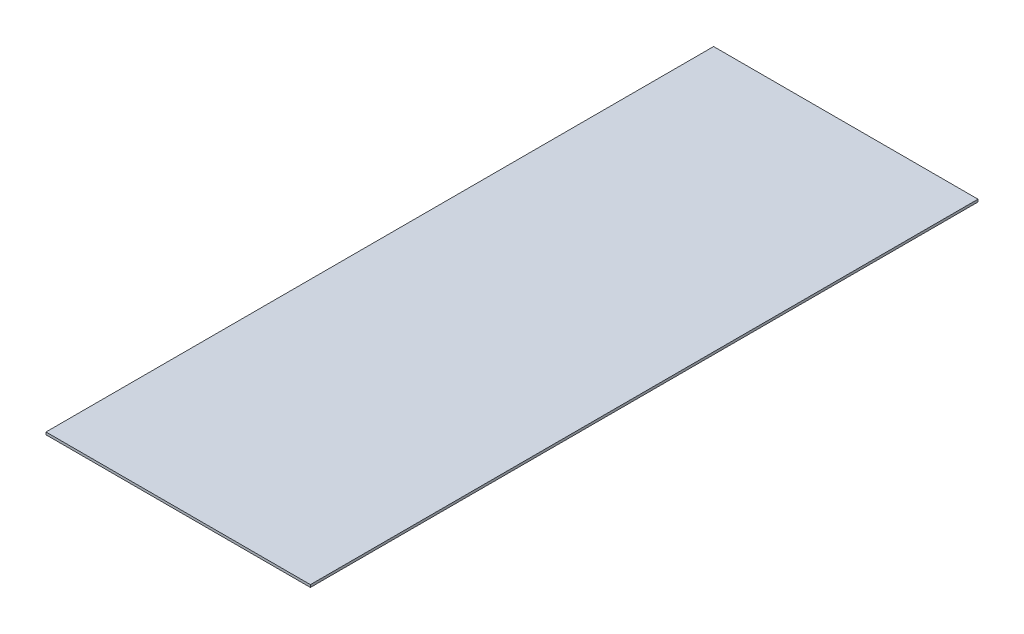
ISO-10303-21;
HEADER;
FILE_DESCRIPTION(('STEP AP214'),'2;1');
FILE_NAME('part.step','',(''),(''),'','','');
FILE_SCHEMA(('AUTOMOTIVE_DESIGN { 1 0 10303 214 1 1 1 1 }'));
ENDSEC;
DATA;
#1=APPLICATION_CONTEXT('core data for automotive mechanical design processes');
#2=APPLICATION_PROTOCOL_DEFINITION('international standard','automotive_design',2000,#1);
#3=PRODUCT_CONTEXT('',#1,'mechanical');
#4=PRODUCT('Part','Part','',(#3));
#5=PRODUCT_RELATED_PRODUCT_CATEGORY('part','',(#4));
#6=PRODUCT_DEFINITION_FORMATION('','',#4);
#7=PRODUCT_DEFINITION_CONTEXT('part definition',#1,'design');
#8=PRODUCT_DEFINITION('design','',#6,#7);
#9=PRODUCT_DEFINITION_SHAPE('','',#8);
#10=(LENGTH_UNIT() NAMED_UNIT(*) SI_UNIT(.MILLI.,.METRE.));
#11=(NAMED_UNIT(*) PLANE_ANGLE_UNIT() SI_UNIT($,.RADIAN.));
#12=(NAMED_UNIT(*) SI_UNIT($,.STERADIAN.) SOLID_ANGLE_UNIT());
#13=UNCERTAINTY_MEASURE_WITH_UNIT(LENGTH_MEASURE(1.E-05),#10,'distance_accuracy_value','');
#14=(GEOMETRIC_REPRESENTATION_CONTEXT(3) GLOBAL_UNCERTAINTY_ASSIGNED_CONTEXT((#13)) GLOBAL_UNIT_ASSIGNED_CONTEXT((#10,
#11,#12)) REPRESENTATION_CONTEXT('',''));
#15=CARTESIAN_POINT('',(0.,0.,0.));
#16=DIRECTION('',(0.,0.,1.));
#17=DIRECTION('',(1.,0.,0.));
#18=AXIS2_PLACEMENT_3D('',#15,#16,#17);
#19=CARTESIAN_POINT('',(-32.2125498928645,1.5,-199.872903465782));
#20=DIRECTION('',(1.,0.,0.));
#21=DIRECTION('',(0.,0.,-1.));
#22=AXIS2_PLACEMENT_3D('',#19,#20,#21);
#23=PLANE('',#22);
#24=DIRECTION('',(0.,0.,1.));
#25=VECTOR('',#24,1.);
#26=CARTESIAN_POINT('',(-32.2125498928645,0.,-199.872903465782));
#27=LINE('',#26,#25);
#28=CARTESIAN_POINT('',(-32.2125498928645,0.,-199.872903465782));
#29=VERTEX_POINT('',#28);
#30=CARTESIAN_POINT('',(-32.2125498928645,0.,204.127096534218));
#31=VERTEX_POINT('',#30);
#32=EDGE_CURVE('E99',#29,#31,#27,.T.);
#33=ORIENTED_EDGE('',*,*,#32,.T.);
#34=DIRECTION('',(0.,-1.,0.));
#35=VECTOR('',#34,1.);
#36=CARTESIAN_POINT('',(-32.2125498928645,1.5,204.127096534218));
#37=LINE('',#36,#35);
#38=CARTESIAN_POINT('',(-32.2125498928645,1.5,204.127096534218));
#39=VERTEX_POINT('',#38);
#40=EDGE_CURVE('E11',#39,#31,#37,.T.);
#41=ORIENTED_EDGE('',*,*,#40,.F.);
#42=DIRECTION('',(0.,0.,1.));
#43=VECTOR('',#42,1.);
#44=CARTESIAN_POINT('',(-32.2125498928645,1.5,-199.872903465782));
#45=LINE('',#44,#43);
#46=CARTESIAN_POINT('',(-32.2125498928645,1.5,-199.872903465782));
#47=VERTEX_POINT('',#46);
#48=EDGE_CURVE('E87',#47,#39,#45,.T.);
#49=ORIENTED_EDGE('',*,*,#48,.F.);
#50=DIRECTION('',(0.,-1.,0.));
#51=VECTOR('',#50,1.);
#52=CARTESIAN_POINT('',(-32.2125498928645,1.5,-199.872903465782));
#53=LINE('',#52,#51);
#54=EDGE_CURVE('E95',#47,#29,#53,.T.);
#55=ORIENTED_EDGE('',*,*,#54,.T.);
#56=EDGE_LOOP('',(#33,#41,#49,#55));
#57=FACE_BOUND('',#56,.T.);
#58=ADVANCED_FACE('F36',(#57),#23,.F.);
#59=CARTESIAN_POINT('',(-32.2125498928645,1.5,204.127096534218));
#60=DIRECTION('',(0.,0.,-1.));
#61=DIRECTION('',(-1.,0.,0.));
#62=AXIS2_PLACEMENT_3D('',#59,#60,#61);
#63=PLANE('',#62);
#64=DIRECTION('',(1.,0.,0.));
#65=VECTOR('',#64,1.);
#66=CARTESIAN_POINT('',(-32.2125498928645,0.,204.127096534218));
#67=LINE('',#66,#65);
#68=CARTESIAN_POINT('',(127.787450107136,0.,204.127096534218));
#69=VERTEX_POINT('',#68);
#70=EDGE_CURVE('E91',#31,#69,#67,.T.);
#71=ORIENTED_EDGE('',*,*,#70,.T.);
#72=DIRECTION('',(0.,-1.,0.));
#73=VECTOR('',#72,1.);
#74=CARTESIAN_POINT('',(127.787450107136,1.5,204.127096534218));
#75=LINE('',#74,#73);
#76=CARTESIAN_POINT('',(127.787450107136,1.5,204.127096534218));
#77=VERTEX_POINT('',#76);
#78=EDGE_CURVE('E44',#77,#69,#75,.T.);
#79=ORIENTED_EDGE('',*,*,#78,.F.);
#80=DIRECTION('',(1.,0.,0.));
#81=VECTOR('',#80,1.);
#82=CARTESIAN_POINT('',(-32.2125498928645,1.5,204.127096534218));
#83=LINE('',#82,#81);
#84=EDGE_CURVE('E82',#39,#77,#83,.T.);
#85=ORIENTED_EDGE('',*,*,#84,.F.);
#86=ORIENTED_EDGE('',*,*,#40,.T.);
#87=EDGE_LOOP('',(#71,#79,#85,#86));
#88=FACE_BOUND('',#87,.T.);
#89=ADVANCED_FACE('F90',(#88),#63,.F.);
#90=CARTESIAN_POINT('',(127.787450107135,1.5,-199.872903465782));
#91=DIRECTION('',(-1.,0.,0.));
#92=DIRECTION('',(0.,0.,1.));
#93=AXIS2_PLACEMENT_3D('',#90,#91,#92);
#94=PLANE('',#93);
#95=DIRECTION('',(0.,0.,-1.));
#96=VECTOR('',#95,1.);
#97=CARTESIAN_POINT('',(127.787450107135,0.,-199.872903465782));
#98=LINE('',#97,#96);
#99=CARTESIAN_POINT('',(127.787450107135,0.,-199.872903465782));
#100=VERTEX_POINT('',#99);
#101=EDGE_CURVE('E69',#69,#100,#98,.T.);
#102=ORIENTED_EDGE('',*,*,#101,.T.);
#103=DIRECTION('',(0.,-1.,0.));
#104=VECTOR('',#103,1.);
#105=CARTESIAN_POINT('',(127.787450107135,1.5,-199.872903465782));
#106=LINE('',#105,#104);
#107=CARTESIAN_POINT('',(127.787450107135,1.5,-199.872903465782));
#108=VERTEX_POINT('',#107);
#109=EDGE_CURVE('E92',#108,#100,#106,.T.);
#110=ORIENTED_EDGE('',*,*,#109,.F.);
#111=DIRECTION('',(0.,0.,-1.));
#112=VECTOR('',#111,1.);
#113=CARTESIAN_POINT('',(127.787450107135,1.5,-199.872903465782));
#114=LINE('',#113,#112);
#115=EDGE_CURVE('E85',#77,#108,#114,.T.);
#116=ORIENTED_EDGE('',*,*,#115,.F.);
#117=ORIENTED_EDGE('',*,*,#78,.T.);
#118=EDGE_LOOP('',(#102,#110,#116,#117));
#119=FACE_BOUND('',#118,.T.);
#120=ADVANCED_FACE('F93',(#119),#94,.F.);
#121=CARTESIAN_POINT('',(-32.2125498928645,1.5,-199.872903465782));
#122=DIRECTION('',(0.,0.,1.));
#123=DIRECTION('',(1.,0.,0.));
#124=AXIS2_PLACEMENT_3D('',#121,#122,#123);
#125=PLANE('',#124);
#126=DIRECTION('',(-1.,0.,0.));
#127=VECTOR('',#126,1.);
#128=CARTESIAN_POINT('',(-32.2125498928645,0.,-199.872903465782));
#129=LINE('',#128,#127);
#130=EDGE_CURVE('E75',#100,#29,#129,.T.);
#131=ORIENTED_EDGE('',*,*,#130,.T.);
#132=ORIENTED_EDGE('',*,*,#54,.F.);
#133=DIRECTION('',(-1.,0.,0.));
#134=VECTOR('',#133,1.);
#135=CARTESIAN_POINT('',(-32.2125498928645,1.5,-199.872903465782));
#136=LINE('',#135,#134);
#137=EDGE_CURVE('E52',#108,#47,#136,.T.);
#138=ORIENTED_EDGE('',*,*,#137,.F.);
#139=ORIENTED_EDGE('',*,*,#109,.T.);
#140=EDGE_LOOP('',(#131,#132,#138,#139));
#141=FACE_BOUND('',#140,.T.);
#142=ADVANCED_FACE('F106',(#141),#125,.F.);
#143=CARTESIAN_POINT('',(0.,1.5,0.));
#144=DIRECTION('',(0.,1.,0.));
#145=DIRECTION('',(0.,0.,1.));
#146=AXIS2_PLACEMENT_3D('',#143,#144,#145);
#147=PLANE('',#146);
#148=ORIENTED_EDGE('',*,*,#48,.T.);
#149=ORIENTED_EDGE('',*,*,#84,.T.);
#150=ORIENTED_EDGE('',*,*,#115,.T.);
#151=ORIENTED_EDGE('',*,*,#137,.T.);
#152=EDGE_LOOP('',(#148,#149,#150,#151));
#153=FACE_BOUND('',#152,.T.);
#154=ADVANCED_FACE('F83',(#153),#147,.T.);
#155=CARTESIAN_POINT('',(0.,0.,0.));
#156=DIRECTION('',(0.,1.,0.));
#157=DIRECTION('',(0.,0.,1.));
#158=AXIS2_PLACEMENT_3D('',#155,#156,#157);
#159=PLANE('',#158);
#160=ORIENTED_EDGE('',*,*,#32,.F.);
#161=ORIENTED_EDGE('',*,*,#130,.F.);
#162=ORIENTED_EDGE('',*,*,#101,.F.);
#163=ORIENTED_EDGE('',*,*,#70,.F.);
#164=EDGE_LOOP('',(#160,#161,#162,#163));
#165=FACE_BOUND('',#164,.T.);
#166=ADVANCED_FACE('F109',(#165),#159,.F.);
#167=CLOSED_SHELL('',(#58,#89,#120,#142,#154,#166));
#168=MANIFOLD_SOLID_BREP('B2',#167);
#169=ADVANCED_BREP_SHAPE_REPRESENTATION('',(#18,#168),#14);
#170=SHAPE_DEFINITION_REPRESENTATION(#9,#169);
ENDSEC;
END-ISO-10303-21;
